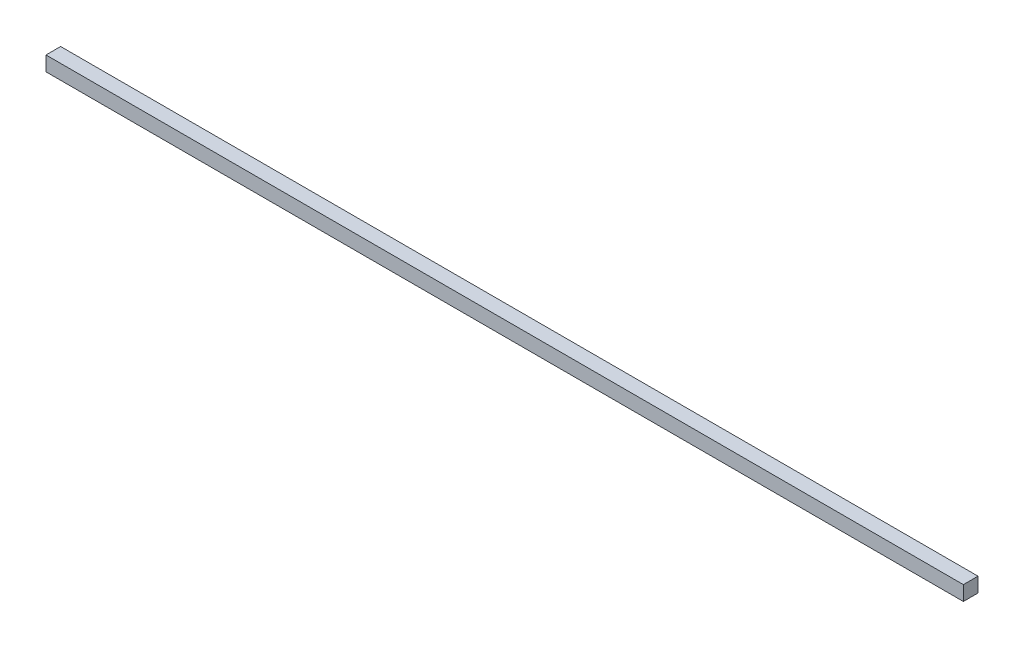
ISO-10303-21;
HEADER;
FILE_DESCRIPTION(('STEP AP214'),'2;1');
FILE_NAME('part.step','',(''),(''),'','','');
FILE_SCHEMA(('AUTOMOTIVE_DESIGN { 1 0 10303 214 1 1 1 1 }'));
ENDSEC;
DATA;
#1=APPLICATION_CONTEXT('core data for automotive mechanical design processes');
#2=APPLICATION_PROTOCOL_DEFINITION('international standard','automotive_design',2000,#1);
#3=PRODUCT_CONTEXT('',#1,'mechanical');
#4=PRODUCT('Part','Part','',(#3));
#5=PRODUCT_RELATED_PRODUCT_CATEGORY('part','',(#4));
#6=PRODUCT_DEFINITION_FORMATION('','',#4);
#7=PRODUCT_DEFINITION_CONTEXT('part definition',#1,'design');
#8=PRODUCT_DEFINITION('design','',#6,#7);
#9=PRODUCT_DEFINITION_SHAPE('','',#8);
#10=(LENGTH_UNIT() NAMED_UNIT(*) SI_UNIT(.MILLI.,.METRE.));
#11=(NAMED_UNIT(*) PLANE_ANGLE_UNIT() SI_UNIT($,.RADIAN.));
#12=(NAMED_UNIT(*) SI_UNIT($,.STERADIAN.) SOLID_ANGLE_UNIT());
#13=UNCERTAINTY_MEASURE_WITH_UNIT(LENGTH_MEASURE(1.E-05),#10,'distance_accuracy_value','');
#14=(GEOMETRIC_REPRESENTATION_CONTEXT(3) GLOBAL_UNCERTAINTY_ASSIGNED_CONTEXT((#13)) GLOBAL_UNIT_ASSIGNED_CONTEXT((#10,
#11,#12)) REPRESENTATION_CONTEXT('',''));
#15=CARTESIAN_POINT('',(0.,0.,0.));
#16=DIRECTION('',(0.,0.,1.));
#17=DIRECTION('',(1.,0.,0.));
#18=AXIS2_PLACEMENT_3D('',#15,#16,#17);
#19=CARTESIAN_POINT('',(-298.45,0.,0.));
#20=DIRECTION('',(0.,0.,1.));
#21=DIRECTION('',(1.,0.,0.));
#22=AXIS2_PLACEMENT_3D('',#19,#20,#21);
#23=PLANE('',#22);
#24=DIRECTION('',(0.,-1.,0.));
#25=VECTOR('',#24,1.);
#26=CARTESIAN_POINT('',(0.,0.,0.));
#27=LINE('',#26,#25);
#28=CARTESIAN_POINT('',(0.,4.7625,0.));
#29=VERTEX_POINT('',#28);
#30=CARTESIAN_POINT('',(0.,0.,0.));
#31=VERTEX_POINT('',#30);
#32=EDGE_CURVE('E109',#29,#31,#27,.T.);
#33=ORIENTED_EDGE('',*,*,#32,.F.);
#34=DIRECTION('',(1.,0.,0.));
#35=VECTOR('',#34,1.);
#36=CARTESIAN_POINT('',(-298.45,4.7625,0.));
#37=LINE('',#36,#35);
#38=CARTESIAN_POINT('',(-298.45,4.7625,0.));
#39=VERTEX_POINT('',#38);
#40=EDGE_CURVE('E11',#39,#29,#37,.T.);
#41=ORIENTED_EDGE('',*,*,#40,.F.);
#42=DIRECTION('',(0.,-1.,0.));
#43=VECTOR('',#42,1.);
#44=CARTESIAN_POINT('',(-298.45,0.,0.));
#45=LINE('',#44,#43);
#46=CARTESIAN_POINT('',(-298.45,0.,0.));
#47=VERTEX_POINT('',#46);
#48=EDGE_CURVE('E103',#39,#47,#45,.T.);
#49=ORIENTED_EDGE('',*,*,#48,.T.);
#50=DIRECTION('',(1.,0.,0.));
#51=VECTOR('',#50,1.);
#52=CARTESIAN_POINT('',(-298.45,0.,0.));
#53=LINE('',#52,#51);
#54=EDGE_CURVE('E48',#47,#31,#53,.T.);
#55=ORIENTED_EDGE('',*,*,#54,.T.);
#56=EDGE_LOOP('',(#33,#41,#49,#55));
#57=FACE_BOUND('',#56,.T.);
#58=ADVANCED_FACE('F45',(#57),#23,.T.);
#59=CARTESIAN_POINT('',(-298.45,4.7625,0.));
#60=DIRECTION('',(0.,1.,0.));
#61=DIRECTION('',(0.,0.,1.));
#62=AXIS2_PLACEMENT_3D('',#59,#60,#61);
#63=PLANE('',#62);
#64=DIRECTION('',(0.,0.,1.));
#65=VECTOR('',#64,1.);
#66=CARTESIAN_POINT('',(0.,4.7625,0.));
#67=LINE('',#66,#65);
#68=CARTESIAN_POINT('',(0.,4.7625,-4.7625));
#69=VERTEX_POINT('',#68);
#70=EDGE_CURVE('E105',#69,#29,#67,.T.);
#71=ORIENTED_EDGE('',*,*,#70,.F.);
#72=DIRECTION('',(1.,0.,0.));
#73=VECTOR('',#72,1.);
#74=CARTESIAN_POINT('',(-298.45,4.7625,-4.7625));
#75=LINE('',#74,#73);
#76=CARTESIAN_POINT('',(-298.45,4.7625,-4.7625));
#77=VERTEX_POINT('',#76);
#78=EDGE_CURVE('E54',#77,#69,#75,.T.);
#79=ORIENTED_EDGE('',*,*,#78,.F.);
#80=DIRECTION('',(0.,0.,1.));
#81=VECTOR('',#80,1.);
#82=CARTESIAN_POINT('',(-298.45,4.7625,0.));
#83=LINE('',#82,#81);
#84=EDGE_CURVE('E100',#77,#39,#83,.T.);
#85=ORIENTED_EDGE('',*,*,#84,.T.);
#86=ORIENTED_EDGE('',*,*,#40,.T.);
#87=EDGE_LOOP('',(#71,#79,#85,#86));
#88=FACE_BOUND('',#87,.T.);
#89=ADVANCED_FACE('F119',(#88),#63,.T.);
#90=CARTESIAN_POINT('',(-298.45,0.,-4.7625));
#91=DIRECTION('',(0.,0.,-1.));
#92=DIRECTION('',(-1.,0.,0.));
#93=AXIS2_PLACEMENT_3D('',#90,#91,#92);
#94=PLANE('',#93);
#95=DIRECTION('',(0.,1.,0.));
#96=VECTOR('',#95,1.);
#97=CARTESIAN_POINT('',(0.,0.,-4.7625));
#98=LINE('',#97,#96);
#99=CARTESIAN_POINT('',(0.,0.,-4.7625));
#100=VERTEX_POINT('',#99);
#101=EDGE_CURVE('E95',#100,#69,#98,.T.);
#102=ORIENTED_EDGE('',*,*,#101,.F.);
#103=DIRECTION('',(1.,0.,0.));
#104=VECTOR('',#103,1.);
#105=CARTESIAN_POINT('',(-298.45,0.,-4.7625));
#106=LINE('',#105,#104);
#107=CARTESIAN_POINT('',(-298.45,0.,-4.7625));
#108=VERTEX_POINT('',#107);
#109=EDGE_CURVE('E90',#108,#100,#106,.T.);
#110=ORIENTED_EDGE('',*,*,#109,.F.);
#111=DIRECTION('',(0.,1.,0.));
#112=VECTOR('',#111,1.);
#113=CARTESIAN_POINT('',(-298.45,0.,-4.7625));
#114=LINE('',#113,#112);
#115=EDGE_CURVE('E93',#108,#77,#114,.T.);
#116=ORIENTED_EDGE('',*,*,#115,.T.);
#117=ORIENTED_EDGE('',*,*,#78,.T.);
#118=EDGE_LOOP('',(#102,#110,#116,#117));
#119=FACE_BOUND('',#118,.T.);
#120=ADVANCED_FACE('F92',(#119),#94,.T.);
#121=CARTESIAN_POINT('',(-298.45,0.,0.));
#122=DIRECTION('',(0.,-1.,0.));
#123=DIRECTION('',(0.,0.,-1.));
#124=AXIS2_PLACEMENT_3D('',#121,#122,#123);
#125=PLANE('',#124);
#126=DIRECTION('',(0.,0.,-1.));
#127=VECTOR('',#126,1.);
#128=CARTESIAN_POINT('',(0.,0.,0.));
#129=LINE('',#128,#127);
#130=EDGE_CURVE('E112',#31,#100,#129,.T.);
#131=ORIENTED_EDGE('',*,*,#130,.F.);
#132=ORIENTED_EDGE('',*,*,#54,.F.);
#133=DIRECTION('',(0.,0.,-1.));
#134=VECTOR('',#133,1.);
#135=CARTESIAN_POINT('',(-298.45,0.,0.));
#136=LINE('',#135,#134);
#137=EDGE_CURVE('E99',#47,#108,#136,.T.);
#138=ORIENTED_EDGE('',*,*,#137,.T.);
#139=ORIENTED_EDGE('',*,*,#109,.T.);
#140=EDGE_LOOP('',(#131,#132,#138,#139));
#141=FACE_BOUND('',#140,.T.);
#142=ADVANCED_FACE('F102',(#141),#125,.T.);
#143=CARTESIAN_POINT('',(-298.45,0.,0.));
#144=DIRECTION('',(-1.,0.,0.));
#145=DIRECTION('',(0.,0.,1.));
#146=AXIS2_PLACEMENT_3D('',#143,#144,#145);
#147=PLANE('',#146);
#148=ORIENTED_EDGE('',*,*,#48,.F.);
#149=ORIENTED_EDGE('',*,*,#84,.F.);
#150=ORIENTED_EDGE('',*,*,#115,.F.);
#151=ORIENTED_EDGE('',*,*,#137,.F.);
#152=EDGE_LOOP('',(#148,#149,#150,#151));
#153=FACE_BOUND('',#152,.T.);
#154=ADVANCED_FACE('F98',(#153),#147,.T.);
#155=CARTESIAN_POINT('',(0.,0.,0.));
#156=DIRECTION('',(-1.,0.,0.));
#157=DIRECTION('',(0.,0.,1.));
#158=AXIS2_PLACEMENT_3D('',#155,#156,#157);
#159=PLANE('',#158);
#160=ORIENTED_EDGE('',*,*,#32,.T.);
#161=ORIENTED_EDGE('',*,*,#130,.T.);
#162=ORIENTED_EDGE('',*,*,#101,.T.);
#163=ORIENTED_EDGE('',*,*,#70,.T.);
#164=EDGE_LOOP('',(#160,#161,#162,#163));
#165=FACE_BOUND('',#164,.T.);
#166=ADVANCED_FACE('F118',(#165),#159,.F.);
#167=CLOSED_SHELL('',(#58,#89,#120,#142,#154,#166));
#168=MANIFOLD_SOLID_BREP('B2',#167);
#169=ADVANCED_BREP_SHAPE_REPRESENTATION('',(#18,#168),#14);
#170=SHAPE_DEFINITION_REPRESENTATION(#9,#169);
ENDSEC;
END-ISO-10303-21;
